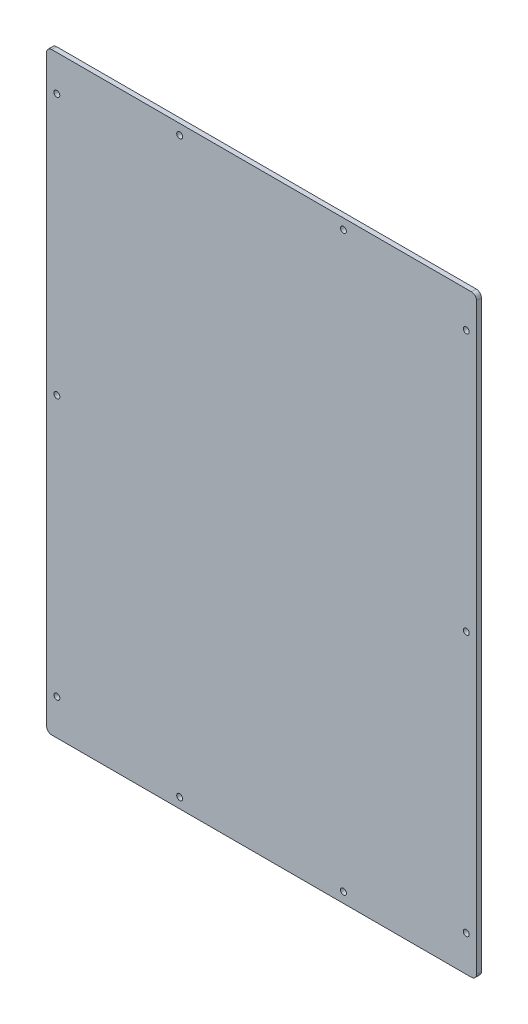
ISO-10303-21;
HEADER;
FILE_DESCRIPTION(('STEP AP214'),'2;1');
FILE_NAME('part.step','',(''),(''),'','','');
FILE_SCHEMA(('AUTOMOTIVE_DESIGN { 1 0 10303 214 1 1 1 1 }'));
ENDSEC;
DATA;
#1=APPLICATION_CONTEXT('core data for automotive mechanical design processes');
#2=APPLICATION_PROTOCOL_DEFINITION('international standard','automotive_design',2000,#1);
#3=PRODUCT_CONTEXT('',#1,'mechanical');
#4=PRODUCT('Part','Part','',(#3));
#5=PRODUCT_RELATED_PRODUCT_CATEGORY('part','',(#4));
#6=PRODUCT_DEFINITION_FORMATION('','',#4);
#7=PRODUCT_DEFINITION_CONTEXT('part definition',#1,'design');
#8=PRODUCT_DEFINITION('design','',#6,#7);
#9=PRODUCT_DEFINITION_SHAPE('','',#8);
#10=(LENGTH_UNIT() NAMED_UNIT(*) SI_UNIT(.MILLI.,.METRE.));
#11=(NAMED_UNIT(*) PLANE_ANGLE_UNIT() SI_UNIT($,.RADIAN.));
#12=(NAMED_UNIT(*) SI_UNIT($,.STERADIAN.) SOLID_ANGLE_UNIT());
#13=UNCERTAINTY_MEASURE_WITH_UNIT(LENGTH_MEASURE(1.E-05),#10,'distance_accuracy_value','');
#14=(GEOMETRIC_REPRESENTATION_CONTEXT(3) GLOBAL_UNCERTAINTY_ASSIGNED_CONTEXT((#13)) GLOBAL_UNIT_ASSIGNED_CONTEXT((#10,
#11,#12)) REPRESENTATION_CONTEXT('',''));
#15=CARTESIAN_POINT('',(0.,0.,0.));
#16=DIRECTION('',(0.,0.,1.));
#17=DIRECTION('',(1.,0.,0.));
#18=AXIS2_PLACEMENT_3D('',#15,#16,#17);
#19=CARTESIAN_POINT('',(-210.,-290.,4.7625));
#20=DIRECTION('',(1.,0.,0.));
#21=DIRECTION('',(0.,1.,0.));
#22=AXIS2_PLACEMENT_3D('',#19,#20,#21);
#23=PLANE('',#22);
#24=DIRECTION('',(0.,-1.,0.));
#25=VECTOR('',#24,1.);
#26=CARTESIAN_POINT('',(-210.,-290.,0.));
#27=LINE('',#26,#25);
#28=CARTESIAN_POINT('',(-210.,285.,0.));
#29=VERTEX_POINT('',#28);
#30=CARTESIAN_POINT('',(-210.,-285.,0.));
#31=VERTEX_POINT('',#30);
#32=EDGE_CURVE('E161',#29,#31,#27,.T.);
#33=ORIENTED_EDGE('',*,*,#32,.T.);
#34=DIRECTION('',(0.,0.,-1.));
#35=VECTOR('',#34,1.);
#36=CARTESIAN_POINT('',(-210.,-285.,4.7625));
#37=LINE('',#36,#35);
#38=CARTESIAN_POINT('',(-210.,-285.,4.7625));
#39=VERTEX_POINT('',#38);
#40=EDGE_CURVE('E11',#31,#39,#37,.F.);
#41=ORIENTED_EDGE('',*,*,#40,.T.);
#42=DIRECTION('',(0.,-1.,0.));
#43=VECTOR('',#42,1.);
#44=CARTESIAN_POINT('',(-210.,-290.,4.7625));
#45=LINE('',#44,#43);
#46=CARTESIAN_POINT('',(-210.,285.,4.7625));
#47=VERTEX_POINT('',#46);
#48=EDGE_CURVE('E129',#47,#39,#45,.T.);
#49=ORIENTED_EDGE('',*,*,#48,.F.);
#50=DIRECTION('',(0.,0.,-1.));
#51=VECTOR('',#50,1.);
#52=CARTESIAN_POINT('',(-210.,285.,4.7625));
#53=LINE('',#52,#51);
#54=EDGE_CURVE('E45',#47,#29,#53,.T.);
#55=ORIENTED_EDGE('',*,*,#54,.T.);
#56=EDGE_LOOP('',(#33,#41,#49,#55));
#57=FACE_BOUND('',#56,.T.);
#58=ADVANCED_FACE('F37',(#57),#23,.F.);
#59=CARTESIAN_POINT('',(210.,-290.,4.7625));
#60=DIRECTION('',(0.,1.,0.));
#61=DIRECTION('',(0.,0.,1.));
#62=AXIS2_PLACEMENT_3D('',#59,#60,#61);
#63=PLANE('',#62);
#64=DIRECTION('',(1.,0.,0.));
#65=VECTOR('',#64,1.);
#66=CARTESIAN_POINT('',(210.,-290.,0.));
#67=LINE('',#66,#65);
#68=CARTESIAN_POINT('',(-205.,-290.,0.));
#69=VERTEX_POINT('',#68);
#70=CARTESIAN_POINT('',(205.,-290.,0.));
#71=VERTEX_POINT('',#70);
#72=EDGE_CURVE('E134',#69,#71,#67,.T.);
#73=ORIENTED_EDGE('',*,*,#72,.T.);
#74=DIRECTION('',(0.,0.,-1.));
#75=VECTOR('',#74,1.);
#76=CARTESIAN_POINT('',(205.,-290.,4.7625));
#77=LINE('',#76,#75);
#78=CARTESIAN_POINT('',(205.,-290.,4.7625));
#79=VERTEX_POINT('',#78);
#80=EDGE_CURVE('E52',#71,#79,#77,.F.);
#81=ORIENTED_EDGE('',*,*,#80,.T.);
#82=DIRECTION('',(1.,0.,0.));
#83=VECTOR('',#82,1.);
#84=CARTESIAN_POINT('',(210.,-290.,4.7625));
#85=LINE('',#84,#83);
#86=CARTESIAN_POINT('',(-205.,-290.,4.7625));
#87=VERTEX_POINT('',#86);
#88=EDGE_CURVE('E132',#87,#79,#85,.T.);
#89=ORIENTED_EDGE('',*,*,#88,.F.);
#90=DIRECTION('',(0.,0.,-1.));
#91=VECTOR('',#90,1.);
#92=CARTESIAN_POINT('',(-205.,-290.,4.7625));
#93=LINE('',#92,#91);
#94=EDGE_CURVE('E153',#87,#69,#93,.T.);
#95=ORIENTED_EDGE('',*,*,#94,.T.);
#96=EDGE_LOOP('',(#73,#81,#89,#95));
#97=FACE_BOUND('',#96,.T.);
#98=ADVANCED_FACE('F264',(#97),#63,.F.);
#99=CARTESIAN_POINT('',(210.,-290.,4.7625));
#100=DIRECTION('',(-1.,0.,0.));
#101=DIRECTION('',(0.,0.,1.));
#102=AXIS2_PLACEMENT_3D('',#99,#100,#101);
#103=PLANE('',#102);
#104=DIRECTION('',(0.,1.,0.));
#105=VECTOR('',#104,1.);
#106=CARTESIAN_POINT('',(210.,-290.,0.));
#107=LINE('',#106,#105);
#108=CARTESIAN_POINT('',(210.,-285.,0.));
#109=VERTEX_POINT('',#108);
#110=CARTESIAN_POINT('',(210.,285.,0.));
#111=VERTEX_POINT('',#110);
#112=EDGE_CURVE('E130',#109,#111,#107,.T.);
#113=ORIENTED_EDGE('',*,*,#112,.T.);
#114=DIRECTION('',(0.,0.,-1.));
#115=VECTOR('',#114,1.);
#116=CARTESIAN_POINT('',(210.,285.,4.7625));
#117=LINE('',#116,#115);
#118=CARTESIAN_POINT('',(210.,285.,4.7625));
#119=VERTEX_POINT('',#118);
#120=EDGE_CURVE('E108',#111,#119,#117,.F.);
#121=ORIENTED_EDGE('',*,*,#120,.T.);
#122=DIRECTION('',(0.,1.,0.));
#123=VECTOR('',#122,1.);
#124=CARTESIAN_POINT('',(210.,-290.,4.7625));
#125=LINE('',#124,#123);
#126=CARTESIAN_POINT('',(210.,-285.,4.7625));
#127=VERTEX_POINT('',#126);
#128=EDGE_CURVE('E173',#127,#119,#125,.T.);
#129=ORIENTED_EDGE('',*,*,#128,.F.);
#130=DIRECTION('',(0.,0.,-1.));
#131=VECTOR('',#130,1.);
#132=CARTESIAN_POINT('',(210.,-285.,4.7625));
#133=LINE('',#132,#131);
#134=EDGE_CURVE('E113',#127,#109,#133,.T.);
#135=ORIENTED_EDGE('',*,*,#134,.T.);
#136=EDGE_LOOP('',(#113,#121,#129,#135));
#137=FACE_BOUND('',#136,.T.);
#138=ADVANCED_FACE('F261',(#137),#103,.F.);
#139=CARTESIAN_POINT('',(210.,290.,4.7625));
#140=DIRECTION('',(0.,-1.,0.));
#141=DIRECTION('',(0.,0.,-1.));
#142=AXIS2_PLACEMENT_3D('',#139,#140,#141);
#143=PLANE('',#142);
#144=DIRECTION('',(-1.,0.,0.));
#145=VECTOR('',#144,1.);
#146=CARTESIAN_POINT('',(210.,290.,4.7625));
#147=LINE('',#146,#145);
#148=CARTESIAN_POINT('',(205.,290.,4.7625));
#149=VERTEX_POINT('',#148);
#150=CARTESIAN_POINT('',(-205.,290.,4.7625));
#151=VERTEX_POINT('',#150);
#152=EDGE_CURVE('E123',#149,#151,#147,.T.);
#153=ORIENTED_EDGE('',*,*,#152,.F.);
#154=DIRECTION('',(0.,0.,-1.));
#155=VECTOR('',#154,1.);
#156=CARTESIAN_POINT('',(205.,290.,4.7625));
#157=LINE('',#156,#155);
#158=CARTESIAN_POINT('',(205.,290.,0.));
#159=VERTEX_POINT('',#158);
#160=EDGE_CURVE('E107',#149,#159,#157,.T.);
#161=ORIENTED_EDGE('',*,*,#160,.T.);
#162=DIRECTION('',(-1.,0.,0.));
#163=VECTOR('',#162,1.);
#164=CARTESIAN_POINT('',(210.,290.,0.));
#165=LINE('',#164,#163);
#166=CARTESIAN_POINT('',(-205.,290.,0.));
#167=VERTEX_POINT('',#166);
#168=EDGE_CURVE('E120',#159,#167,#165,.T.);
#169=ORIENTED_EDGE('',*,*,#168,.T.);
#170=DIRECTION('',(0.,0.,-1.));
#171=VECTOR('',#170,1.);
#172=CARTESIAN_POINT('',(-205.,290.,4.7625));
#173=LINE('',#172,#171);
#174=EDGE_CURVE('E125',#167,#151,#173,.F.);
#175=ORIENTED_EDGE('',*,*,#174,.T.);
#176=EDGE_LOOP('',(#153,#161,#169,#175));
#177=FACE_BOUND('',#176,.T.);
#178=ADVANCED_FACE('F119',(#177),#143,.F.);
#179=CARTESIAN_POINT('',(0.,0.,4.7625));
#180=DIRECTION('',(0.,0.,1.));
#181=DIRECTION('',(1.,0.,0.));
#182=AXIS2_PLACEMENT_3D('',#179,#180,#181);
#183=PLANE('',#182);
#184=CARTESIAN_POINT('',(-200.,255.,4.7625));
#185=DIRECTION('',(0.,0.,1.));
#186=DIRECTION('',(1.,0.,0.));
#187=AXIS2_PLACEMENT_3D('',#184,#185,#186);
#188=CIRCLE('',#187,2.89999999999999);
#189=CARTESIAN_POINT('',(-197.1,255.,4.7625));
#190=VERTEX_POINT('',#189);
#191=EDGE_CURVE('E230',#190,#190,#188,.T.);
#192=ORIENTED_EDGE('',*,*,#191,.F.);
#193=EDGE_LOOP('',(#192));
#194=FACE_BOUND('',#193,.T.);
#195=CARTESIAN_POINT('',(-200.,0.,4.7625));
#196=DIRECTION('',(0.,0.,1.));
#197=DIRECTION('',(1.,0.,0.));
#198=AXIS2_PLACEMENT_3D('',#195,#196,#197);
#199=CIRCLE('',#198,2.89999999999999);
#200=CARTESIAN_POINT('',(-197.1,0.,4.7625));
#201=VERTEX_POINT('',#200);
#202=EDGE_CURVE('E224',#201,#201,#199,.T.);
#203=ORIENTED_EDGE('',*,*,#202,.F.);
#204=EDGE_LOOP('',(#203));
#205=FACE_BOUND('',#204,.T.);
#206=CARTESIAN_POINT('',(-200.,-255.,4.7625));
#207=DIRECTION('',(0.,0.,1.));
#208=DIRECTION('',(1.,0.,0.));
#209=AXIS2_PLACEMENT_3D('',#206,#207,#208);
#210=CIRCLE('',#209,2.89999999999999);
#211=CARTESIAN_POINT('',(-197.1,-255.,4.7625));
#212=VERTEX_POINT('',#211);
#213=EDGE_CURVE('E218',#212,#212,#210,.T.);
#214=ORIENTED_EDGE('',*,*,#213,.F.);
#215=EDGE_LOOP('',(#214));
#216=FACE_BOUND('',#215,.T.);
#217=CARTESIAN_POINT('',(200.,255.,4.7625));
#218=DIRECTION('',(0.,0.,1.));
#219=DIRECTION('',(1.,0.,0.));
#220=AXIS2_PLACEMENT_3D('',#217,#218,#219);
#221=CIRCLE('',#220,2.89999999999999);
#222=CARTESIAN_POINT('',(202.9,255.,4.7625));
#223=VERTEX_POINT('',#222);
#224=EDGE_CURVE('E212',#223,#223,#221,.T.);
#225=ORIENTED_EDGE('',*,*,#224,.F.);
#226=EDGE_LOOP('',(#225));
#227=FACE_BOUND('',#226,.T.);
#228=CARTESIAN_POINT('',(200.,0.,4.7625));
#229=DIRECTION('',(0.,0.,1.));
#230=DIRECTION('',(1.,0.,0.));
#231=AXIS2_PLACEMENT_3D('',#228,#229,#230);
#232=CIRCLE('',#231,2.89999999999999);
#233=CARTESIAN_POINT('',(202.9,0.,4.7625));
#234=VERTEX_POINT('',#233);
#235=EDGE_CURVE('E206',#234,#234,#232,.T.);
#236=ORIENTED_EDGE('',*,*,#235,.F.);
#237=EDGE_LOOP('',(#236));
#238=FACE_BOUND('',#237,.T.);
#239=CARTESIAN_POINT('',(200.,-255.,4.7625));
#240=DIRECTION('',(0.,0.,1.));
#241=DIRECTION('',(1.,0.,0.));
#242=AXIS2_PLACEMENT_3D('',#239,#240,#241);
#243=CIRCLE('',#242,2.89999999999999);
#244=CARTESIAN_POINT('',(202.9,-255.,4.7625));
#245=VERTEX_POINT('',#244);
#246=EDGE_CURVE('E200',#245,#245,#243,.T.);
#247=ORIENTED_EDGE('',*,*,#246,.F.);
#248=EDGE_LOOP('',(#247));
#249=FACE_BOUND('',#248,.T.);
#250=CARTESIAN_POINT('',(-80.,280.,4.7625));
#251=DIRECTION('',(0.,0.,1.));
#252=DIRECTION('',(1.,0.,0.));
#253=AXIS2_PLACEMENT_3D('',#250,#251,#252);
#254=CIRCLE('',#253,2.89999999999999);
#255=CARTESIAN_POINT('',(-77.1,280.,4.7625));
#256=VERTEX_POINT('',#255);
#257=EDGE_CURVE('E194',#256,#256,#254,.T.);
#258=ORIENTED_EDGE('',*,*,#257,.F.);
#259=EDGE_LOOP('',(#258));
#260=FACE_BOUND('',#259,.T.);
#261=CARTESIAN_POINT('',(80.,280.,4.7625));
#262=DIRECTION('',(0.,0.,1.));
#263=DIRECTION('',(1.,0.,0.));
#264=AXIS2_PLACEMENT_3D('',#261,#262,#263);
#265=CIRCLE('',#264,2.89999999999999);
#266=CARTESIAN_POINT('',(82.9,280.,4.7625));
#267=VERTEX_POINT('',#266);
#268=EDGE_CURVE('E188',#267,#267,#265,.T.);
#269=ORIENTED_EDGE('',*,*,#268,.F.);
#270=EDGE_LOOP('',(#269));
#271=FACE_BOUND('',#270,.T.);
#272=CARTESIAN_POINT('',(80.,-280.,4.7625));
#273=DIRECTION('',(0.,0.,1.));
#274=DIRECTION('',(1.,0.,0.));
#275=AXIS2_PLACEMENT_3D('',#272,#273,#274);
#276=CIRCLE('',#275,2.89999999999999);
#277=CARTESIAN_POINT('',(82.9,-280.,4.7625));
#278=VERTEX_POINT('',#277);
#279=EDGE_CURVE('E182',#278,#278,#276,.T.);
#280=ORIENTED_EDGE('',*,*,#279,.F.);
#281=EDGE_LOOP('',(#280));
#282=FACE_BOUND('',#281,.T.);
#283=CARTESIAN_POINT('',(-80.,-280.,4.7625));
#284=DIRECTION('',(0.,0.,1.));
#285=DIRECTION('',(1.,0.,0.));
#286=AXIS2_PLACEMENT_3D('',#283,#284,#285);
#287=CIRCLE('',#286,2.89999999999999);
#288=CARTESIAN_POINT('',(-77.1,-280.,4.7625));
#289=VERTEX_POINT('',#288);
#290=EDGE_CURVE('E169',#289,#289,#287,.T.);
#291=ORIENTED_EDGE('',*,*,#290,.F.);
#292=EDGE_LOOP('',(#291));
#293=FACE_BOUND('',#292,.T.);
#294=ORIENTED_EDGE('',*,*,#128,.T.);
#295=CARTESIAN_POINT('',(205.,285.,4.7625));
#296=DIRECTION('',(0.,0.,1.));
#297=DIRECTION('',(1.,0.,0.));
#298=AXIS2_PLACEMENT_3D('',#295,#296,#297);
#299=CIRCLE('',#298,5.);
#300=EDGE_CURVE('E151',#119,#149,#299,.T.);
#301=ORIENTED_EDGE('',*,*,#300,.T.);
#302=ORIENTED_EDGE('',*,*,#152,.T.);
#303=CARTESIAN_POINT('',(-205.,285.,4.7625));
#304=DIRECTION('',(0.,0.,1.));
#305=DIRECTION('',(1.,0.,0.));
#306=AXIS2_PLACEMENT_3D('',#303,#304,#305);
#307=CIRCLE('',#306,5.);
#308=EDGE_CURVE('E146',#151,#47,#307,.T.);
#309=ORIENTED_EDGE('',*,*,#308,.T.);
#310=ORIENTED_EDGE('',*,*,#48,.T.);
#311=CARTESIAN_POINT('',(-205.,-285.,4.7625));
#312=DIRECTION('',(0.,0.,1.));
#313=DIRECTION('',(1.,0.,0.));
#314=AXIS2_PLACEMENT_3D('',#311,#312,#313);
#315=CIRCLE('',#314,5.);
#316=EDGE_CURVE('E59',#39,#87,#315,.T.);
#317=ORIENTED_EDGE('',*,*,#316,.T.);
#318=ORIENTED_EDGE('',*,*,#88,.T.);
#319=CARTESIAN_POINT('',(205.,-285.,4.7625));
#320=DIRECTION('',(0.,0.,1.));
#321=DIRECTION('',(1.,0.,0.));
#322=AXIS2_PLACEMENT_3D('',#319,#320,#321);
#323=CIRCLE('',#322,5.);
#324=EDGE_CURVE('E149',#79,#127,#323,.T.);
#325=ORIENTED_EDGE('',*,*,#324,.T.);
#326=EDGE_LOOP('',(#294,#301,#302,#309,#310,#317,#318,#325));
#327=FACE_BOUND('',#326,.T.);
#328=ADVANCED_FACE('F236',(#194,#205,#216,#227,#238,#249,#260,#271,#282,#293,#327),#183,.T.);
#329=CARTESIAN_POINT('',(0.,0.,0.));
#330=DIRECTION('',(0.,0.,1.));
#331=DIRECTION('',(1.,0.,0.));
#332=AXIS2_PLACEMENT_3D('',#329,#330,#331);
#333=PLANE('',#332);
#334=CARTESIAN_POINT('',(-200.,255.,0.));
#335=DIRECTION('',(0.,0.,1.));
#336=DIRECTION('',(1.,0.,0.));
#337=AXIS2_PLACEMENT_3D('',#334,#335,#336);
#338=CIRCLE('',#337,2.89999999999999);
#339=CARTESIAN_POINT('',(-197.1,255.,0.));
#340=VERTEX_POINT('',#339);
#341=EDGE_CURVE('E227',#340,#340,#338,.T.);
#342=ORIENTED_EDGE('',*,*,#341,.T.);
#343=EDGE_LOOP('',(#342));
#344=FACE_BOUND('',#343,.T.);
#345=CARTESIAN_POINT('',(-200.,0.,0.));
#346=DIRECTION('',(0.,0.,1.));
#347=DIRECTION('',(1.,0.,0.));
#348=AXIS2_PLACEMENT_3D('',#345,#346,#347);
#349=CIRCLE('',#348,2.89999999999999);
#350=CARTESIAN_POINT('',(-197.1,0.,0.));
#351=VERTEX_POINT('',#350);
#352=EDGE_CURVE('E221',#351,#351,#349,.T.);
#353=ORIENTED_EDGE('',*,*,#352,.T.);
#354=EDGE_LOOP('',(#353));
#355=FACE_BOUND('',#354,.T.);
#356=CARTESIAN_POINT('',(-200.,-255.,0.));
#357=DIRECTION('',(0.,0.,1.));
#358=DIRECTION('',(1.,0.,0.));
#359=AXIS2_PLACEMENT_3D('',#356,#357,#358);
#360=CIRCLE('',#359,2.89999999999999);
#361=CARTESIAN_POINT('',(-197.1,-255.,0.));
#362=VERTEX_POINT('',#361);
#363=EDGE_CURVE('E215',#362,#362,#360,.T.);
#364=ORIENTED_EDGE('',*,*,#363,.T.);
#365=EDGE_LOOP('',(#364));
#366=FACE_BOUND('',#365,.T.);
#367=CARTESIAN_POINT('',(200.,255.,0.));
#368=DIRECTION('',(0.,0.,1.));
#369=DIRECTION('',(1.,0.,0.));
#370=AXIS2_PLACEMENT_3D('',#367,#368,#369);
#371=CIRCLE('',#370,2.89999999999999);
#372=CARTESIAN_POINT('',(202.9,255.,0.));
#373=VERTEX_POINT('',#372);
#374=EDGE_CURVE('E209',#373,#373,#371,.T.);
#375=ORIENTED_EDGE('',*,*,#374,.T.);
#376=EDGE_LOOP('',(#375));
#377=FACE_BOUND('',#376,.T.);
#378=CARTESIAN_POINT('',(200.,0.,0.));
#379=DIRECTION('',(0.,0.,1.));
#380=DIRECTION('',(1.,0.,0.));
#381=AXIS2_PLACEMENT_3D('',#378,#379,#380);
#382=CIRCLE('',#381,2.89999999999999);
#383=CARTESIAN_POINT('',(202.9,0.,0.));
#384=VERTEX_POINT('',#383);
#385=EDGE_CURVE('E203',#384,#384,#382,.T.);
#386=ORIENTED_EDGE('',*,*,#385,.T.);
#387=EDGE_LOOP('',(#386));
#388=FACE_BOUND('',#387,.T.);
#389=CARTESIAN_POINT('',(200.,-255.,0.));
#390=DIRECTION('',(0.,0.,1.));
#391=DIRECTION('',(1.,0.,0.));
#392=AXIS2_PLACEMENT_3D('',#389,#390,#391);
#393=CIRCLE('',#392,2.89999999999999);
#394=CARTESIAN_POINT('',(202.9,-255.,0.));
#395=VERTEX_POINT('',#394);
#396=EDGE_CURVE('E197',#395,#395,#393,.T.);
#397=ORIENTED_EDGE('',*,*,#396,.T.);
#398=EDGE_LOOP('',(#397));
#399=FACE_BOUND('',#398,.T.);
#400=CARTESIAN_POINT('',(-80.,280.,0.));
#401=DIRECTION('',(0.,0.,1.));
#402=DIRECTION('',(1.,0.,0.));
#403=AXIS2_PLACEMENT_3D('',#400,#401,#402);
#404=CIRCLE('',#403,2.9);
#405=CARTESIAN_POINT('',(-77.1,280.,0.));
#406=VERTEX_POINT('',#405);
#407=EDGE_CURVE('E191',#406,#406,#404,.T.);
#408=ORIENTED_EDGE('',*,*,#407,.T.);
#409=EDGE_LOOP('',(#408));
#410=FACE_BOUND('',#409,.T.);
#411=CARTESIAN_POINT('',(80.,280.,0.));
#412=DIRECTION('',(0.,0.,1.));
#413=DIRECTION('',(1.,0.,0.));
#414=AXIS2_PLACEMENT_3D('',#411,#412,#413);
#415=CIRCLE('',#414,2.9);
#416=CARTESIAN_POINT('',(82.9,280.,0.));
#417=VERTEX_POINT('',#416);
#418=EDGE_CURVE('E185',#417,#417,#415,.T.);
#419=ORIENTED_EDGE('',*,*,#418,.T.);
#420=EDGE_LOOP('',(#419));
#421=FACE_BOUND('',#420,.T.);
#422=CARTESIAN_POINT('',(80.,-280.,0.));
#423=DIRECTION('',(0.,0.,1.));
#424=DIRECTION('',(1.,0.,0.));
#425=AXIS2_PLACEMENT_3D('',#422,#423,#424);
#426=CIRCLE('',#425,2.9);
#427=CARTESIAN_POINT('',(82.9,-280.,0.));
#428=VERTEX_POINT('',#427);
#429=EDGE_CURVE('E179',#428,#428,#426,.T.);
#430=ORIENTED_EDGE('',*,*,#429,.T.);
#431=EDGE_LOOP('',(#430));
#432=FACE_BOUND('',#431,.T.);
#433=CARTESIAN_POINT('',(-80.,-280.,0.));
#434=DIRECTION('',(0.,0.,1.));
#435=DIRECTION('',(1.,0.,0.));
#436=AXIS2_PLACEMENT_3D('',#433,#434,#435);
#437=CIRCLE('',#436,2.9);
#438=CARTESIAN_POINT('',(-77.1,-280.,0.));
#439=VERTEX_POINT('',#438);
#440=EDGE_CURVE('E166',#439,#439,#437,.T.);
#441=ORIENTED_EDGE('',*,*,#440,.T.);
#442=EDGE_LOOP('',(#441));
#443=FACE_BOUND('',#442,.T.);
#444=ORIENTED_EDGE('',*,*,#168,.F.);
#445=CARTESIAN_POINT('',(205.,285.,0.));
#446=DIRECTION('',(0.,0.,1.));
#447=DIRECTION('',(1.,0.,0.));
#448=AXIS2_PLACEMENT_3D('',#445,#446,#447);
#449=CIRCLE('',#448,5.);
#450=EDGE_CURVE('E103',#159,#111,#449,.F.);
#451=ORIENTED_EDGE('',*,*,#450,.T.);
#452=ORIENTED_EDGE('',*,*,#112,.F.);
#453=CARTESIAN_POINT('',(205.,-285.,0.));
#454=DIRECTION('',(0.,0.,1.));
#455=DIRECTION('',(1.,0.,0.));
#456=AXIS2_PLACEMENT_3D('',#453,#454,#455);
#457=CIRCLE('',#456,5.);
#458=EDGE_CURVE('E114',#109,#71,#457,.F.);
#459=ORIENTED_EDGE('',*,*,#458,.T.);
#460=ORIENTED_EDGE('',*,*,#72,.F.);
#461=CARTESIAN_POINT('',(-205.,-285.,0.));
#462=DIRECTION('',(0.,0.,1.));
#463=DIRECTION('',(1.,0.,0.));
#464=AXIS2_PLACEMENT_3D('',#461,#462,#463);
#465=CIRCLE('',#464,5.);
#466=EDGE_CURVE('E140',#69,#31,#465,.F.);
#467=ORIENTED_EDGE('',*,*,#466,.T.);
#468=ORIENTED_EDGE('',*,*,#32,.F.);
#469=CARTESIAN_POINT('',(-205.,285.,0.));
#470=DIRECTION('',(0.,0.,1.));
#471=DIRECTION('',(1.,0.,0.));
#472=AXIS2_PLACEMENT_3D('',#469,#470,#471);
#473=CIRCLE('',#472,5.);
#474=EDGE_CURVE('E124',#29,#167,#473,.F.);
#475=ORIENTED_EDGE('',*,*,#474,.T.);
#476=EDGE_LOOP('',(#444,#451,#452,#459,#460,#467,#468,#475));
#477=FACE_BOUND('',#476,.T.);
#478=ADVANCED_FACE('F127',(#344,#355,#366,#377,#388,#399,#410,#421,#432,#443,#477),#333,.F.);
#479=CARTESIAN_POINT('',(-80.,-280.,4.7625));
#480=DIRECTION('',(0.,0.,1.));
#481=DIRECTION('',(1.,0.,0.));
#482=AXIS2_PLACEMENT_3D('',#479,#480,#481);
#483=CYLINDRICAL_SURFACE('',#482,2.89999999999999);
#484=ORIENTED_EDGE('',*,*,#440,.F.);
#485=EDGE_LOOP('',(#484));
#486=FACE_BOUND('',#485,.T.);
#487=ORIENTED_EDGE('',*,*,#290,.T.);
#488=EDGE_LOOP('',(#487));
#489=FACE_BOUND('',#488,.T.);
#490=ADVANCED_FACE('F397',(#486,#489),#483,.F.);
#491=CARTESIAN_POINT('',(80.,-280.,4.7625));
#492=DIRECTION('',(0.,0.,1.));
#493=DIRECTION('',(1.,0.,0.));
#494=AXIS2_PLACEMENT_3D('',#491,#492,#493);
#495=CYLINDRICAL_SURFACE('',#494,2.89999999999999);
#496=ORIENTED_EDGE('',*,*,#429,.F.);
#497=EDGE_LOOP('',(#496));
#498=FACE_BOUND('',#497,.T.);
#499=ORIENTED_EDGE('',*,*,#279,.T.);
#500=EDGE_LOOP('',(#499));
#501=FACE_BOUND('',#500,.T.);
#502=ADVANCED_FACE('F387',(#498,#501),#495,.F.);
#503=CARTESIAN_POINT('',(80.,280.,4.7625));
#504=DIRECTION('',(0.,0.,1.));
#505=DIRECTION('',(1.,0.,0.));
#506=AXIS2_PLACEMENT_3D('',#503,#504,#505);
#507=CYLINDRICAL_SURFACE('',#506,2.89999999999999);
#508=ORIENTED_EDGE('',*,*,#418,.F.);
#509=EDGE_LOOP('',(#508));
#510=FACE_BOUND('',#509,.T.);
#511=ORIENTED_EDGE('',*,*,#268,.T.);
#512=EDGE_LOOP('',(#511));
#513=FACE_BOUND('',#512,.T.);
#514=ADVANCED_FACE('F377',(#510,#513),#507,.F.);
#515=CARTESIAN_POINT('',(-80.,280.,4.7625));
#516=DIRECTION('',(0.,0.,1.));
#517=DIRECTION('',(1.,0.,0.));
#518=AXIS2_PLACEMENT_3D('',#515,#516,#517);
#519=CYLINDRICAL_SURFACE('',#518,2.89999999999999);
#520=ORIENTED_EDGE('',*,*,#407,.F.);
#521=EDGE_LOOP('',(#520));
#522=FACE_BOUND('',#521,.T.);
#523=ORIENTED_EDGE('',*,*,#257,.T.);
#524=EDGE_LOOP('',(#523));
#525=FACE_BOUND('',#524,.T.);
#526=ADVANCED_FACE('F367',(#522,#525),#519,.F.);
#527=CARTESIAN_POINT('',(200.,-255.,4.7625));
#528=DIRECTION('',(0.,0.,1.));
#529=DIRECTION('',(1.,0.,0.));
#530=AXIS2_PLACEMENT_3D('',#527,#528,#529);
#531=CYLINDRICAL_SURFACE('',#530,2.89999999999999);
#532=ORIENTED_EDGE('',*,*,#396,.F.);
#533=EDGE_LOOP('',(#532));
#534=FACE_BOUND('',#533,.T.);
#535=ORIENTED_EDGE('',*,*,#246,.T.);
#536=EDGE_LOOP('',(#535));
#537=FACE_BOUND('',#536,.T.);
#538=ADVANCED_FACE('F357',(#534,#537),#531,.F.);
#539=CARTESIAN_POINT('',(200.,0.,4.7625));
#540=DIRECTION('',(0.,0.,1.));
#541=DIRECTION('',(1.,0.,0.));
#542=AXIS2_PLACEMENT_3D('',#539,#540,#541);
#543=CYLINDRICAL_SURFACE('',#542,2.89999999999999);
#544=ORIENTED_EDGE('',*,*,#385,.F.);
#545=EDGE_LOOP('',(#544));
#546=FACE_BOUND('',#545,.T.);
#547=ORIENTED_EDGE('',*,*,#235,.T.);
#548=EDGE_LOOP('',(#547));
#549=FACE_BOUND('',#548,.T.);
#550=ADVANCED_FACE('F347',(#546,#549),#543,.F.);
#551=CARTESIAN_POINT('',(200.,255.,4.7625));
#552=DIRECTION('',(0.,0.,1.));
#553=DIRECTION('',(1.,0.,0.));
#554=AXIS2_PLACEMENT_3D('',#551,#552,#553);
#555=CYLINDRICAL_SURFACE('',#554,2.89999999999999);
#556=ORIENTED_EDGE('',*,*,#374,.F.);
#557=EDGE_LOOP('',(#556));
#558=FACE_BOUND('',#557,.T.);
#559=ORIENTED_EDGE('',*,*,#224,.T.);
#560=EDGE_LOOP('',(#559));
#561=FACE_BOUND('',#560,.T.);
#562=ADVANCED_FACE('F337',(#558,#561),#555,.F.);
#563=CARTESIAN_POINT('',(-200.,-255.,4.7625));
#564=DIRECTION('',(0.,0.,1.));
#565=DIRECTION('',(1.,0.,0.));
#566=AXIS2_PLACEMENT_3D('',#563,#564,#565);
#567=CYLINDRICAL_SURFACE('',#566,2.89999999999999);
#568=ORIENTED_EDGE('',*,*,#363,.F.);
#569=EDGE_LOOP('',(#568));
#570=FACE_BOUND('',#569,.T.);
#571=ORIENTED_EDGE('',*,*,#213,.T.);
#572=EDGE_LOOP('',(#571));
#573=FACE_BOUND('',#572,.T.);
#574=ADVANCED_FACE('F327',(#570,#573),#567,.F.);
#575=CARTESIAN_POINT('',(-200.,0.,4.7625));
#576=DIRECTION('',(0.,0.,1.));
#577=DIRECTION('',(1.,0.,0.));
#578=AXIS2_PLACEMENT_3D('',#575,#576,#577);
#579=CYLINDRICAL_SURFACE('',#578,2.89999999999999);
#580=ORIENTED_EDGE('',*,*,#352,.F.);
#581=EDGE_LOOP('',(#580));
#582=FACE_BOUND('',#581,.T.);
#583=ORIENTED_EDGE('',*,*,#202,.T.);
#584=EDGE_LOOP('',(#583));
#585=FACE_BOUND('',#584,.T.);
#586=ADVANCED_FACE('F317',(#582,#585),#579,.F.);
#587=CARTESIAN_POINT('',(-200.,255.,4.7625));
#588=DIRECTION('',(0.,0.,1.));
#589=DIRECTION('',(1.,0.,0.));
#590=AXIS2_PLACEMENT_3D('',#587,#588,#589);
#591=CYLINDRICAL_SURFACE('',#590,2.89999999999999);
#592=ORIENTED_EDGE('',*,*,#341,.F.);
#593=EDGE_LOOP('',(#592));
#594=FACE_BOUND('',#593,.T.);
#595=ORIENTED_EDGE('',*,*,#191,.T.);
#596=EDGE_LOOP('',(#595));
#597=FACE_BOUND('',#596,.T.);
#598=ADVANCED_FACE('F234',(#594,#597),#591,.F.);
#599=CARTESIAN_POINT('',(205.,285.,4.7625));
#600=DIRECTION('',(0.,0.,-1.));
#601=DIRECTION('',(-1.,0.,0.));
#602=AXIS2_PLACEMENT_3D('',#599,#600,#601);
#603=CYLINDRICAL_SURFACE('',#602,5.);
#604=ORIENTED_EDGE('',*,*,#300,.F.);
#605=ORIENTED_EDGE('',*,*,#120,.F.);
#606=ORIENTED_EDGE('',*,*,#450,.F.);
#607=ORIENTED_EDGE('',*,*,#160,.F.);
#608=EDGE_LOOP('',(#604,#605,#606,#607));
#609=FACE_BOUND('',#608,.T.);
#610=ADVANCED_FACE('F106',(#609),#603,.T.);
#611=CARTESIAN_POINT('',(205.,-285.,4.7625));
#612=DIRECTION('',(0.,0.,-1.));
#613=DIRECTION('',(-1.,0.,0.));
#614=AXIS2_PLACEMENT_3D('',#611,#612,#613);
#615=CYLINDRICAL_SURFACE('',#614,5.);
#616=ORIENTED_EDGE('',*,*,#324,.F.);
#617=ORIENTED_EDGE('',*,*,#80,.F.);
#618=ORIENTED_EDGE('',*,*,#458,.F.);
#619=ORIENTED_EDGE('',*,*,#134,.F.);
#620=EDGE_LOOP('',(#616,#617,#618,#619));
#621=FACE_BOUND('',#620,.T.);
#622=ADVANCED_FACE('F263',(#621),#615,.T.);
#623=CARTESIAN_POINT('',(-205.,-285.,4.7625));
#624=DIRECTION('',(0.,0.,-1.));
#625=DIRECTION('',(-1.,0.,0.));
#626=AXIS2_PLACEMENT_3D('',#623,#624,#625);
#627=CYLINDRICAL_SURFACE('',#626,5.);
#628=ORIENTED_EDGE('',*,*,#316,.F.);
#629=ORIENTED_EDGE('',*,*,#40,.F.);
#630=ORIENTED_EDGE('',*,*,#466,.F.);
#631=ORIENTED_EDGE('',*,*,#94,.F.);
#632=EDGE_LOOP('',(#628,#629,#630,#631));
#633=FACE_BOUND('',#632,.T.);
#634=ADVANCED_FACE('F267',(#633),#627,.T.);
#635=CARTESIAN_POINT('',(-205.,285.,4.7625));
#636=DIRECTION('',(0.,0.,-1.));
#637=DIRECTION('',(-1.,0.,0.));
#638=AXIS2_PLACEMENT_3D('',#635,#636,#637);
#639=CYLINDRICAL_SURFACE('',#638,5.);
#640=ORIENTED_EDGE('',*,*,#308,.F.);
#641=ORIENTED_EDGE('',*,*,#174,.F.);
#642=ORIENTED_EDGE('',*,*,#474,.F.);
#643=ORIENTED_EDGE('',*,*,#54,.F.);
#644=EDGE_LOOP('',(#640,#641,#642,#643));
#645=FACE_BOUND('',#644,.T.);
#646=ADVANCED_FACE('F39',(#645),#639,.T.);
#647=CLOSED_SHELL('',(#58,#98,#138,#178,#328,#478,#490,#502,#514,#526,#538,#550,#562,#574,#586,
#598,#610,#622,#634,#646));
#648=MANIFOLD_SOLID_BREP('B2',#647);
#649=ADVANCED_BREP_SHAPE_REPRESENTATION('',(#18,#648),#14);
#650=SHAPE_DEFINITION_REPRESENTATION(#9,#649);
ENDSEC;
END-ISO-10303-21;
